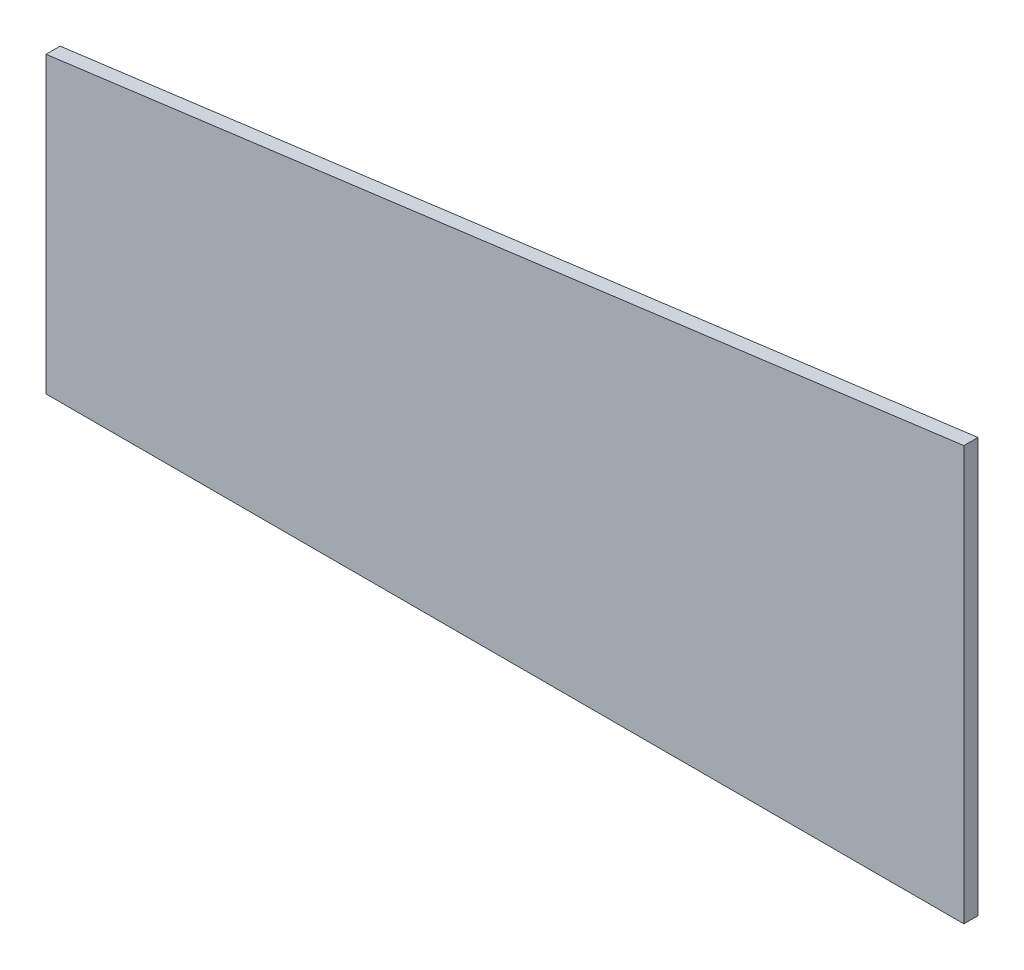
ISO-10303-21;
HEADER;
FILE_DESCRIPTION(('STEP AP214'),'2;1');
FILE_NAME('part.step','',(''),(''),'','','');
FILE_SCHEMA(('AUTOMOTIVE_DESIGN { 1 0 10303 214 1 1 1 1 }'));
ENDSEC;
DATA;
#1=APPLICATION_CONTEXT('core data for automotive mechanical design processes');
#2=APPLICATION_PROTOCOL_DEFINITION('international standard','automotive_design',2000,#1);
#3=PRODUCT_CONTEXT('',#1,'mechanical');
#4=PRODUCT('Part','Part','',(#3));
#5=PRODUCT_RELATED_PRODUCT_CATEGORY('part','',(#4));
#6=PRODUCT_DEFINITION_FORMATION('','',#4);
#7=PRODUCT_DEFINITION_CONTEXT('part definition',#1,'design');
#8=PRODUCT_DEFINITION('design','',#6,#7);
#9=PRODUCT_DEFINITION_SHAPE('','',#8);
#10=(LENGTH_UNIT() NAMED_UNIT(*) SI_UNIT(.MILLI.,.METRE.));
#11=(NAMED_UNIT(*) PLANE_ANGLE_UNIT() SI_UNIT($,.RADIAN.));
#12=(NAMED_UNIT(*) SI_UNIT($,.STERADIAN.) SOLID_ANGLE_UNIT());
#13=UNCERTAINTY_MEASURE_WITH_UNIT(LENGTH_MEASURE(1.E-05),#10,'distance_accuracy_value','');
#14=(GEOMETRIC_REPRESENTATION_CONTEXT(3) GLOBAL_UNCERTAINTY_ASSIGNED_CONTEXT((#13)) GLOBAL_UNIT_ASSIGNED_CONTEXT((#10,
#11,#12)) REPRESENTATION_CONTEXT('',''));
#15=CARTESIAN_POINT('',(0.,0.,0.));
#16=DIRECTION('',(0.,0.,1.));
#17=DIRECTION('',(1.,0.,0.));
#18=AXIS2_PLACEMENT_3D('',#15,#16,#17);
#19=CARTESIAN_POINT('',(373.0625,-3611.5625,19.05));
#20=DIRECTION('',(0.,1.,0.));
#21=DIRECTION('',(0.,0.,1.));
#22=AXIS2_PLACEMENT_3D('',#19,#20,#21);
#23=PLANE('',#22);
#24=DIRECTION('',(1.,0.,0.));
#25=VECTOR('',#24,1.);
#26=CARTESIAN_POINT('',(373.0625,-3611.5625,0.));
#27=LINE('',#26,#25);
#28=CARTESIAN_POINT('',(-865.1875,-3611.5625,0.));
#29=VERTEX_POINT('',#28);
#30=CARTESIAN_POINT('',(373.0625,-3611.5625,0.));
#31=VERTEX_POINT('',#30);
#32=EDGE_CURVE('E94',#29,#31,#27,.T.);
#33=ORIENTED_EDGE('',*,*,#32,.T.);
#34=DIRECTION('',(0.,0.,-1.));
#35=VECTOR('',#34,1.);
#36=CARTESIAN_POINT('',(373.0625,-3611.5625,19.05));
#37=LINE('',#36,#35);
#38=CARTESIAN_POINT('',(373.0625,-3611.5625,19.05));
#39=VERTEX_POINT('',#38);
#40=EDGE_CURVE('E11',#39,#31,#37,.T.);
#41=ORIENTED_EDGE('',*,*,#40,.F.);
#42=DIRECTION('',(1.,0.,0.));
#43=VECTOR('',#42,1.);
#44=CARTESIAN_POINT('',(373.0625,-3611.5625,19.05));
#45=LINE('',#44,#43);
#46=CARTESIAN_POINT('',(-865.1875,-3611.5625,19.05));
#47=VERTEX_POINT('',#46);
#48=EDGE_CURVE('E82',#47,#39,#45,.T.);
#49=ORIENTED_EDGE('',*,*,#48,.F.);
#50=DIRECTION('',(0.,0.,-1.));
#51=VECTOR('',#50,1.);
#52=CARTESIAN_POINT('',(-865.1875,-3611.5625,19.05));
#53=LINE('',#52,#51);
#54=EDGE_CURVE('E90',#47,#29,#53,.T.);
#55=ORIENTED_EDGE('',*,*,#54,.T.);
#56=EDGE_LOOP('',(#33,#41,#49,#55));
#57=FACE_BOUND('',#56,.T.);
#58=ADVANCED_FACE('F31',(#57),#23,.F.);
#59=CARTESIAN_POINT('',(373.0625,-3052.77249081568,19.05));
#60=DIRECTION('',(-1.,0.,0.));
#61=DIRECTION('',(0.,0.,1.));
#62=AXIS2_PLACEMENT_3D('',#59,#60,#61);
#63=PLANE('',#62);
#64=DIRECTION('',(0.,1.,0.));
#65=VECTOR('',#64,1.);
#66=CARTESIAN_POINT('',(373.0625,-3052.77249081568,0.));
#67=LINE('',#66,#65);
#68=CARTESIAN_POINT('',(373.0625,-3052.77249081568,0.));
#69=VERTEX_POINT('',#68);
#70=EDGE_CURVE('E86',#31,#69,#67,.T.);
#71=ORIENTED_EDGE('',*,*,#70,.T.);
#72=DIRECTION('',(0.,0.,-1.));
#73=VECTOR('',#72,1.);
#74=CARTESIAN_POINT('',(373.0625,-3052.77249081568,19.05));
#75=LINE('',#74,#73);
#76=CARTESIAN_POINT('',(373.0625,-3052.77249081568,19.05));
#77=VERTEX_POINT('',#76);
#78=EDGE_CURVE('E39',#77,#69,#75,.T.);
#79=ORIENTED_EDGE('',*,*,#78,.F.);
#80=DIRECTION('',(0.,1.,0.));
#81=VECTOR('',#80,1.);
#82=CARTESIAN_POINT('',(373.0625,-3052.77249081568,19.05));
#83=LINE('',#82,#81);
#84=EDGE_CURVE('E77',#39,#77,#83,.T.);
#85=ORIENTED_EDGE('',*,*,#84,.F.);
#86=ORIENTED_EDGE('',*,*,#40,.T.);
#87=EDGE_LOOP('',(#71,#79,#85,#86));
#88=FACE_BOUND('',#87,.T.);
#89=ADVANCED_FACE('F85',(#88),#63,.F.);
#90=CARTESIAN_POINT('',(-865.1875,-3214.6875,19.05));
#91=DIRECTION('',(0.129657388258693,-0.991558854365153,0.));
#92=DIRECTION('',(0.991558854365153,0.129657388258693,0.));
#93=AXIS2_PLACEMENT_3D('',#90,#91,#92);
#94=PLANE('',#93);
#95=DIRECTION('',(-0.991558854365153,-0.129657388258693,0.));
#96=VECTOR('',#95,1.);
#97=CARTESIAN_POINT('',(-865.1875,-3214.6875,0.));
#98=LINE('',#97,#96);
#99=CARTESIAN_POINT('',(-865.1875,-3214.6875,0.));
#100=VERTEX_POINT('',#99);
#101=EDGE_CURVE('E64',#69,#100,#98,.T.);
#102=ORIENTED_EDGE('',*,*,#101,.T.);
#103=DIRECTION('',(0.,0.,-1.));
#104=VECTOR('',#103,1.);
#105=CARTESIAN_POINT('',(-865.1875,-3214.6875,19.05));
#106=LINE('',#105,#104);
#107=CARTESIAN_POINT('',(-865.1875,-3214.6875,19.05));
#108=VERTEX_POINT('',#107);
#109=EDGE_CURVE('E87',#108,#100,#106,.T.);
#110=ORIENTED_EDGE('',*,*,#109,.F.);
#111=DIRECTION('',(-0.991558854365153,-0.129657388258693,0.));
#112=VECTOR('',#111,1.);
#113=CARTESIAN_POINT('',(-865.1875,-3214.6875,19.05));
#114=LINE('',#113,#112);
#115=EDGE_CURVE('E80',#77,#108,#114,.T.);
#116=ORIENTED_EDGE('',*,*,#115,.F.);
#117=ORIENTED_EDGE('',*,*,#78,.T.);
#118=EDGE_LOOP('',(#102,#110,#116,#117));
#119=FACE_BOUND('',#118,.T.);
#120=ADVANCED_FACE('F88',(#119),#94,.F.);
#121=CARTESIAN_POINT('',(-865.1875,-3611.5625,19.05));
#122=DIRECTION('',(1.,0.,0.));
#123=DIRECTION('',(0.,0.,-1.));
#124=AXIS2_PLACEMENT_3D('',#121,#122,#123);
#125=PLANE('',#124);
#126=DIRECTION('',(0.,-1.,0.));
#127=VECTOR('',#126,1.);
#128=CARTESIAN_POINT('',(-865.1875,-3611.5625,0.));
#129=LINE('',#128,#127);
#130=EDGE_CURVE('E70',#100,#29,#129,.T.);
#131=ORIENTED_EDGE('',*,*,#130,.T.);
#132=ORIENTED_EDGE('',*,*,#54,.F.);
#133=DIRECTION('',(0.,-1.,0.));
#134=VECTOR('',#133,1.);
#135=CARTESIAN_POINT('',(-865.1875,-3611.5625,19.05));
#136=LINE('',#135,#134);
#137=EDGE_CURVE('E47',#108,#47,#136,.T.);
#138=ORIENTED_EDGE('',*,*,#137,.F.);
#139=ORIENTED_EDGE('',*,*,#109,.T.);
#140=EDGE_LOOP('',(#131,#132,#138,#139));
#141=FACE_BOUND('',#140,.T.);
#142=ADVANCED_FACE('F101',(#141),#125,.F.);
#143=CARTESIAN_POINT('',(-865.1875,-3611.5625,19.05));
#144=DIRECTION('',(0.,0.,-1.));
#145=DIRECTION('',(-1.,0.,0.));
#146=AXIS2_PLACEMENT_3D('',#143,#144,#145);
#147=PLANE('',#146);
#148=ORIENTED_EDGE('',*,*,#48,.T.);
#149=ORIENTED_EDGE('',*,*,#84,.T.);
#150=ORIENTED_EDGE('',*,*,#115,.T.);
#151=ORIENTED_EDGE('',*,*,#137,.T.);
#152=EDGE_LOOP('',(#148,#149,#150,#151));
#153=FACE_BOUND('',#152,.T.);
#154=ADVANCED_FACE('F78',(#153),#147,.F.);
#155=CARTESIAN_POINT('',(-865.1875,-3611.5625,0.));
#156=DIRECTION('',(0.,0.,-1.));
#157=DIRECTION('',(-1.,0.,0.));
#158=AXIS2_PLACEMENT_3D('',#155,#156,#157);
#159=PLANE('',#158);
#160=ORIENTED_EDGE('',*,*,#32,.F.);
#161=ORIENTED_EDGE('',*,*,#130,.F.);
#162=ORIENTED_EDGE('',*,*,#101,.F.);
#163=ORIENTED_EDGE('',*,*,#70,.F.);
#164=EDGE_LOOP('',(#160,#161,#162,#163));
#165=FACE_BOUND('',#164,.T.);
#166=ADVANCED_FACE('F104',(#165),#159,.T.);
#167=CLOSED_SHELL('',(#58,#89,#120,#142,#154,#166));
#168=MANIFOLD_SOLID_BREP('B2',#167);
#169=ADVANCED_BREP_SHAPE_REPRESENTATION('',(#18,#168),#14);
#170=SHAPE_DEFINITION_REPRESENTATION(#9,#169);
ENDSEC;
END-ISO-10303-21;
